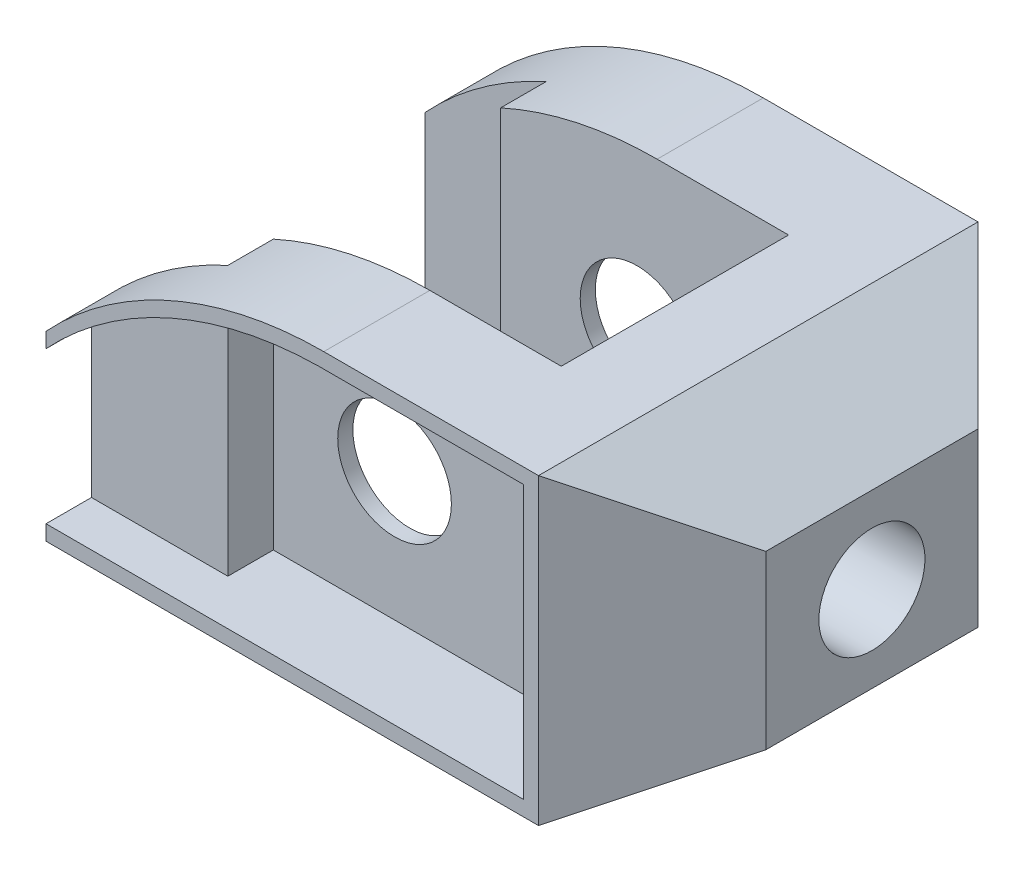
ISO-10303-21;
HEADER;
FILE_DESCRIPTION(('STEP AP214'),'2;1');
FILE_NAME('part.step','',(''),(''),'','','');
FILE_SCHEMA(('AUTOMOTIVE_DESIGN { 1 0 10303 214 1 1 1 1 }'));
ENDSEC;
DATA;
#1=APPLICATION_CONTEXT('core data for automotive mechanical design processes');
#2=APPLICATION_PROTOCOL_DEFINITION('international standard','automotive_design',2000,#1);
#3=PRODUCT_CONTEXT('',#1,'mechanical');
#4=PRODUCT('Part','Part','',(#3));
#5=PRODUCT_RELATED_PRODUCT_CATEGORY('part','',(#4));
#6=PRODUCT_DEFINITION_FORMATION('','',#4);
#7=PRODUCT_DEFINITION_CONTEXT('part definition',#1,'design');
#8=PRODUCT_DEFINITION('design','',#6,#7);
#9=PRODUCT_DEFINITION_SHAPE('','',#8);
#10=(LENGTH_UNIT() NAMED_UNIT(*) SI_UNIT(.MILLI.,.METRE.));
#11=(NAMED_UNIT(*) PLANE_ANGLE_UNIT() SI_UNIT($,.RADIAN.));
#12=(NAMED_UNIT(*) SI_UNIT($,.STERADIAN.) SOLID_ANGLE_UNIT());
#13=UNCERTAINTY_MEASURE_WITH_UNIT(LENGTH_MEASURE(1.E-05),#10,'distance_accuracy_value','');
#14=(GEOMETRIC_REPRESENTATION_CONTEXT(3) GLOBAL_UNCERTAINTY_ASSIGNED_CONTEXT((#13)) GLOBAL_UNIT_ASSIGNED_CONTEXT((#10,
#11,#12)) REPRESENTATION_CONTEXT('',''));
#15=CARTESIAN_POINT('',(0.,0.,0.));
#16=DIRECTION('',(0.,0.,1.));
#17=DIRECTION('',(1.,0.,0.));
#18=AXIS2_PLACEMENT_3D('',#15,#16,#17);
#19=CARTESIAN_POINT('',(-22.,0.,-17.));
#20=DIRECTION('',(1.,0.,0.));
#21=DIRECTION('',(0.,1.,0.));
#22=AXIS2_PLACEMENT_3D('',#19,#20,#21);
#23=PLANE('',#22);
#24=DIRECTION('',(0.,0.,-1.));
#25=VECTOR('',#24,1.);
#26=CARTESIAN_POINT('',(-22.,2.,-17.));
#27=LINE('',#26,#25);
#28=CARTESIAN_POINT('',(-22.,2.,-17.));
#29=VERTEX_POINT('',#28);
#30=CARTESIAN_POINT('',(-22.,2.,-23.));
#31=VERTEX_POINT('',#30);
#32=EDGE_CURVE('E268',#29,#31,#27,.T.);
#33=ORIENTED_EDGE('',*,*,#32,.T.);
#34=DIRECTION('',(0.,-1.,0.));
#35=VECTOR('',#34,1.);
#36=CARTESIAN_POINT('',(-22.,2.,-23.));
#37=LINE('',#36,#35);
#38=CARTESIAN_POINT('',(-22.,34.3900721601075,-23.));
#39=VERTEX_POINT('',#38);
#40=EDGE_CURVE('E275',#39,#31,#37,.T.);
#41=ORIENTED_EDGE('',*,*,#40,.F.);
#42=DIRECTION('',(0.,0.,-1.));
#43=VECTOR('',#42,1.);
#44=CARTESIAN_POINT('',(-22.,34.3900721601075,-17.));
#45=LINE('',#44,#43);
#46=CARTESIAN_POINT('',(-22.,34.3900721601075,-17.));
#47=VERTEX_POINT('',#46);
#48=EDGE_CURVE('E299',#47,#39,#45,.T.);
#49=ORIENTED_EDGE('',*,*,#48,.F.);
#50=DIRECTION('',(0.,-1.,0.));
#51=VECTOR('',#50,1.);
#52=CARTESIAN_POINT('',(-22.,0.,-17.));
#53=LINE('',#52,#51);
#54=EDGE_CURVE('E285',#47,#29,#53,.T.);
#55=ORIENTED_EDGE('',*,*,#54,.T.);
#56=EDGE_LOOP('',(#33,#41,#49,#55));
#57=FACE_BOUND('',#56,.T.);
#58=ADVANCED_FACE('F65',(#57),#23,.T.);
#59=CARTESIAN_POINT('',(-40.,40.,-29.));
#60=DIRECTION('',(0.,0.,1.));
#61=DIRECTION('',(1.,0.,0.));
#62=AXIS2_PLACEMENT_3D('',#59,#60,#61);
#63=PLANE('',#62);
#64=CARTESIAN_POINT('',(-3.33529710869688,-11.995581505432,-29.));
#65=DIRECTION('',(0.,0.,-1.));
#66=DIRECTION('',(-1.,0.,0.));
#67=AXIS2_PLACEMENT_3D('',#64,#65,#66);
#68=CIRCLE('',#67,50.);
#69=CARTESIAN_POINT('',(-40.,22.,-29.));
#70=VERTEX_POINT('',#69);
#71=CARTESIAN_POINT('',(-3.99999999999998,38.,-29.));
#72=VERTEX_POINT('',#71);
#73=EDGE_CURVE('E990',#70,#72,#68,.T.);
#74=ORIENTED_EDGE('',*,*,#73,.F.);
#75=DIRECTION('',(0.,-1.,0.));
#76=VECTOR('',#75,1.);
#77=CARTESIAN_POINT('',(-40.,40.,-29.));
#78=LINE('',#77,#76);
#79=CARTESIAN_POINT('',(-40.,24.,-29.));
#80=VERTEX_POINT('',#79);
#81=EDGE_CURVE('E456',#80,#70,#78,.T.);
#82=ORIENTED_EDGE('',*,*,#81,.F.);
#83=CARTESIAN_POINT('',(-3.33939444035326,-9.99999999999999,-29.));
#84=DIRECTION('',(0.,0.,1.));
#85=DIRECTION('',(1.,0.,0.));
#86=AXIS2_PLACEMENT_3D('',#83,#84,#85);
#87=CIRCLE('',#86,50.);
#88=CARTESIAN_POINT('',(-3.33939444035327,40.,-29.));
#89=VERTEX_POINT('',#88);
#90=EDGE_CURVE('E432',#80,#89,#87,.F.);
#91=ORIENTED_EDGE('',*,*,#90,.T.);
#92=DIRECTION('',(-1.,0.,0.));
#93=VECTOR('',#92,1.);
#94=CARTESIAN_POINT('',(-40.,40.,-29.));
#95=LINE('',#94,#93);
#96=CARTESIAN_POINT('',(25.,40.,-29.));
#97=VERTEX_POINT('',#96);
#98=EDGE_CURVE('E436',#97,#89,#95,.T.);
#99=ORIENTED_EDGE('',*,*,#98,.F.);
#100=DIRECTION('',(0.,-1.,0.));
#101=VECTOR('',#100,1.);
#102=CARTESIAN_POINT('',(25.,98.,-29.));
#103=LINE('',#102,#101);
#104=CARTESIAN_POINT('',(25.,0.,-29.));
#105=VERTEX_POINT('',#104);
#106=EDGE_CURVE('E352',#97,#105,#103,.T.);
#107=ORIENTED_EDGE('',*,*,#106,.T.);
#108=DIRECTION('',(-1.,0.,0.));
#109=VECTOR('',#108,1.);
#110=CARTESIAN_POINT('',(-40.,0.,-29.));
#111=LINE('',#110,#109);
#112=CARTESIAN_POINT('',(-40.,0.,-29.));
#113=VERTEX_POINT('',#112);
#114=EDGE_CURVE('E435',#105,#113,#111,.T.);
#115=ORIENTED_EDGE('',*,*,#114,.T.);
#116=CARTESIAN_POINT('',(-40.,2.,-29.));
#117=VERTEX_POINT('',#116);
#118=EDGE_CURVE('E455',#117,#113,#78,.T.);
#119=ORIENTED_EDGE('',*,*,#118,.F.);
#120=DIRECTION('',(-1.,0.,0.));
#121=VECTOR('',#120,1.);
#122=CARTESIAN_POINT('',(0.,2.,-29.));
#123=LINE('',#122,#121);
#124=CARTESIAN_POINT('',(23.,2.,-29.));
#125=VERTEX_POINT('',#124);
#126=EDGE_CURVE('E293',#125,#117,#123,.T.);
#127=ORIENTED_EDGE('',*,*,#126,.F.);
#128=DIRECTION('',(0.,-1.,0.));
#129=VECTOR('',#128,1.);
#130=CARTESIAN_POINT('',(23.,0.,-29.));
#131=LINE('',#130,#129);
#132=CARTESIAN_POINT('',(23.,38.,-29.));
#133=VERTEX_POINT('',#132);
#134=EDGE_CURVE('E1011',#133,#125,#131,.T.);
#135=ORIENTED_EDGE('',*,*,#134,.F.);
#136=DIRECTION('',(-1.,0.,0.));
#137=VECTOR('',#136,1.);
#138=CARTESIAN_POINT('',(0.,38.,-29.));
#139=LINE('',#138,#137);
#140=EDGE_CURVE('E1009',#133,#72,#139,.T.);
#141=ORIENTED_EDGE('',*,*,#140,.T.);
#142=EDGE_LOOP('',(#74,#82,#91,#99,#107,#115,#119,#127,#135,#141));
#143=FACE_BOUND('',#142,.T.);
#144=ADVANCED_FACE('F509',(#143),#63,.F.);
#145=CARTESIAN_POINT('',(-5.99999999999999,19.,58.));
#146=DIRECTION('',(0.,0.,-1.));
#147=DIRECTION('',(-1.,0.,0.));
#148=AXIS2_PLACEMENT_3D('',#145,#146,#147);
#149=CYLINDRICAL_SURFACE('',#148,7.5);
#150=CARTESIAN_POINT('',(-5.99999999999999,19.,-15.));
#151=DIRECTION('',(0.,0.,-1.));
#152=DIRECTION('',(-1.,0.,0.));
#153=AXIS2_PLACEMENT_3D('',#150,#151,#152);
#154=CIRCLE('',#153,7.5);
#155=CARTESIAN_POINT('',(-13.5,19.,-15.));
#156=VERTEX_POINT('',#155);
#157=EDGE_CURVE('E413',#156,#156,#154,.T.);
#158=ORIENTED_EDGE('',*,*,#157,.F.);
#159=EDGE_LOOP('',(#158));
#160=FACE_BOUND('',#159,.T.);
#161=CARTESIAN_POINT('',(-5.99999999999999,19.,-17.));
#162=DIRECTION('',(0.,0.,-1.));
#163=DIRECTION('',(-1.,0.,0.));
#164=AXIS2_PLACEMENT_3D('',#161,#162,#163);
#165=CIRCLE('',#164,7.5);
#166=CARTESIAN_POINT('',(-13.5,19.,-17.));
#167=VERTEX_POINT('',#166);
#168=EDGE_CURVE('E994',#167,#167,#165,.F.);
#169=ORIENTED_EDGE('',*,*,#168,.F.);
#170=EDGE_LOOP('',(#169));
#171=FACE_BOUND('',#170,.T.);
#172=ADVANCED_FACE('F539',(#160,#171),#149,.F.);
#173=CARTESIAN_POINT('',(-22.,0.,17.));
#174=DIRECTION('',(-1.,0.,0.));
#175=DIRECTION('',(0.,-1.,0.));
#176=AXIS2_PLACEMENT_3D('',#173,#174,#175);
#177=PLANE('',#176);
#178=DIRECTION('',(0.,1.,0.));
#179=VECTOR('',#178,1.);
#180=CARTESIAN_POINT('',(-22.,1.99999999999999,23.));
#181=LINE('',#180,#179);
#182=CARTESIAN_POINT('',(-22.,1.99999999999999,23.));
#183=VERTEX_POINT('',#182);
#184=CARTESIAN_POINT('',(-22.,34.3900721601075,23.));
#185=VERTEX_POINT('',#184);
#186=EDGE_CURVE('E80',#183,#185,#181,.T.);
#187=ORIENTED_EDGE('',*,*,#186,.F.);
#188=DIRECTION('',(0.,0.,1.));
#189=VECTOR('',#188,1.);
#190=CARTESIAN_POINT('',(-22.,1.99999999999999,17.));
#191=LINE('',#190,#189);
#192=CARTESIAN_POINT('',(-22.,1.99999999999999,17.));
#193=VERTEX_POINT('',#192);
#194=EDGE_CURVE('E345',#193,#183,#191,.T.);
#195=ORIENTED_EDGE('',*,*,#194,.F.);
#196=DIRECTION('',(0.,-1.,0.));
#197=VECTOR('',#196,1.);
#198=CARTESIAN_POINT('',(-22.,0.,17.));
#199=LINE('',#198,#197);
#200=CARTESIAN_POINT('',(-22.,34.3900721601075,17.));
#201=VERTEX_POINT('',#200);
#202=EDGE_CURVE('E323',#201,#193,#199,.T.);
#203=ORIENTED_EDGE('',*,*,#202,.F.);
#204=DIRECTION('',(0.,0.,1.));
#205=VECTOR('',#204,1.);
#206=CARTESIAN_POINT('',(-22.,34.3900721601075,17.));
#207=LINE('',#206,#205);
#208=EDGE_CURVE('E348',#201,#185,#207,.T.);
#209=ORIENTED_EDGE('',*,*,#208,.T.);
#210=EDGE_LOOP('',(#187,#195,#203,#209));
#211=FACE_BOUND('',#210,.T.);
#212=ADVANCED_FACE('F560',(#211),#177,.F.);
#213=CARTESIAN_POINT('',(-5.99999999999999,19.,15.));
#214=DIRECTION('',(0.,0.,-1.));
#215=DIRECTION('',(-1.,0.,0.));
#216=AXIS2_PLACEMENT_3D('',#213,#214,#215);
#217=CIRCLE('',#216,7.5);
#218=CARTESIAN_POINT('',(-13.5,19.,15.));
#219=VERTEX_POINT('',#218);
#220=EDGE_CURVE('E406',#219,#219,#217,.T.);
#221=ORIENTED_EDGE('',*,*,#220,.T.);
#222=EDGE_LOOP('',(#221));
#223=FACE_BOUND('',#222,.T.);
#224=CARTESIAN_POINT('',(-5.99999999999999,19.,17.));
#225=DIRECTION('',(0.,0.,1.));
#226=DIRECTION('',(1.,0.,0.));
#227=AXIS2_PLACEMENT_3D('',#224,#225,#226);
#228=CIRCLE('',#227,7.5);
#229=CARTESIAN_POINT('',(1.5,19.,17.));
#230=VERTEX_POINT('',#229);
#231=EDGE_CURVE('E313',#230,#230,#228,.F.);
#232=ORIENTED_EDGE('',*,*,#231,.F.);
#233=EDGE_LOOP('',(#232));
#234=FACE_BOUND('',#233,.T.);
#235=ADVANCED_FACE('F563',(#223,#234),#149,.F.);
#236=CARTESIAN_POINT('',(40.,40.,-29.));
#237=DIRECTION('',(-1.,0.,0.));
#238=DIRECTION('',(0.,0.,1.));
#239=AXIS2_PLACEMENT_3D('',#236,#237,#238);
#240=PLANE('',#239);
#241=CARTESIAN_POINT('',(40.,20.,0.));
#242=DIRECTION('',(-1.,0.,0.));
#243=DIRECTION('',(0.,0.,1.));
#244=AXIS2_PLACEMENT_3D('',#241,#242,#243);
#245=CIRCLE('',#244,7.);
#246=CARTESIAN_POINT('',(40.,20.,7.));
#247=VERTEX_POINT('',#246);
#248=EDGE_CURVE('E368',#247,#247,#245,.F.);
#249=ORIENTED_EDGE('',*,*,#248,.F.);
#250=EDGE_LOOP('',(#249));
#251=FACE_BOUND('',#250,.T.);
#252=DIRECTION('',(0.,-1.,0.));
#253=VECTOR('',#252,1.);
#254=CARTESIAN_POINT('',(40.,98.,-14.));
#255=LINE('',#254,#253);
#256=CARTESIAN_POINT('',(40.,31.3397459621557,-14.));
#257=VERTEX_POINT('',#256);
#258=CARTESIAN_POINT('',(40.,8.66025403784428,-14.));
#259=VERTEX_POINT('',#258);
#260=EDGE_CURVE('E355',#257,#259,#255,.T.);
#261=ORIENTED_EDGE('',*,*,#260,.F.);
#262=DIRECTION('',(0.,0.,-1.));
#263=VECTOR('',#262,1.);
#264=CARTESIAN_POINT('',(40.,31.3397459621557,58.));
#265=LINE('',#264,#263);
#266=CARTESIAN_POINT('',(40.,31.3397459621557,14.0000000000002));
#267=VERTEX_POINT('',#266);
#268=EDGE_CURVE('E420',#267,#257,#265,.T.);
#269=ORIENTED_EDGE('',*,*,#268,.F.);
#270=DIRECTION('',(0.,-1.,0.));
#271=VECTOR('',#270,1.);
#272=CARTESIAN_POINT('',(40.,98.,14.0000000000002));
#273=LINE('',#272,#271);
#274=CARTESIAN_POINT('',(40.,8.66025403784428,14.0000000000002));
#275=VERTEX_POINT('',#274);
#276=EDGE_CURVE('E341',#267,#275,#273,.T.);
#277=ORIENTED_EDGE('',*,*,#276,.T.);
#278=DIRECTION('',(0.,0.,1.));
#279=VECTOR('',#278,1.);
#280=CARTESIAN_POINT('',(40.,8.66025403784428,-58.));
#281=LINE('',#280,#279);
#282=EDGE_CURVE('E419',#259,#275,#281,.T.);
#283=ORIENTED_EDGE('',*,*,#282,.F.);
#284=EDGE_LOOP('',(#261,#269,#277,#283));
#285=FACE_BOUND('',#284,.T.);
#286=ADVANCED_FACE('F67',(#251,#285),#240,.F.);
#287=CARTESIAN_POINT('',(-40.,40.,29.));
#288=DIRECTION('',(0.,0.,-1.));
#289=DIRECTION('',(-1.,0.,0.));
#290=AXIS2_PLACEMENT_3D('',#287,#288,#289);
#291=PLANE('',#290);
#292=DIRECTION('',(-1.,0.,0.));
#293=VECTOR('',#292,1.);
#294=CARTESIAN_POINT('',(0.,2.,29.));
#295=LINE('',#294,#293);
#296=CARTESIAN_POINT('',(23.,2.,29.));
#297=VERTEX_POINT('',#296);
#298=CARTESIAN_POINT('',(-40.,1.99999999999999,29.));
#299=VERTEX_POINT('',#298);
#300=EDGE_CURVE('E335',#297,#299,#295,.T.);
#301=ORIENTED_EDGE('',*,*,#300,.T.);
#302=DIRECTION('',(0.,-1.,0.));
#303=VECTOR('',#302,1.);
#304=CARTESIAN_POINT('',(-40.,40.,29.));
#305=LINE('',#304,#303);
#306=CARTESIAN_POINT('',(-40.,0.,29.));
#307=VERTEX_POINT('',#306);
#308=EDGE_CURVE('E443',#299,#307,#305,.T.);
#309=ORIENTED_EDGE('',*,*,#308,.T.);
#310=DIRECTION('',(1.,0.,0.));
#311=VECTOR('',#310,1.);
#312=CARTESIAN_POINT('',(-40.,0.,29.));
#313=LINE('',#312,#311);
#314=CARTESIAN_POINT('',(25.,0.,29.));
#315=VERTEX_POINT('',#314);
#316=EDGE_CURVE('E440',#307,#315,#313,.T.);
#317=ORIENTED_EDGE('',*,*,#316,.T.);
#318=DIRECTION('',(0.,-1.,0.));
#319=VECTOR('',#318,1.);
#320=CARTESIAN_POINT('',(25.,98.,29.));
#321=LINE('',#320,#319);
#322=CARTESIAN_POINT('',(25.,40.,29.));
#323=VERTEX_POINT('',#322);
#324=EDGE_CURVE('E356',#323,#315,#321,.T.);
#325=ORIENTED_EDGE('',*,*,#324,.F.);
#326=DIRECTION('',(1.,0.,0.));
#327=VECTOR('',#326,1.);
#328=CARTESIAN_POINT('',(-40.,40.,29.));
#329=LINE('',#328,#327);
#330=CARTESIAN_POINT('',(-3.33939444035326,40.,29.));
#331=VERTEX_POINT('',#330);
#332=EDGE_CURVE('E439',#331,#323,#329,.T.);
#333=ORIENTED_EDGE('',*,*,#332,.F.);
#334=CARTESIAN_POINT('',(-3.33939444035326,-9.99999999999999,29.));
#335=DIRECTION('',(0.,0.,-1.));
#336=DIRECTION('',(-1.,0.,0.));
#337=AXIS2_PLACEMENT_3D('',#334,#335,#336);
#338=CIRCLE('',#337,50.);
#339=CARTESIAN_POINT('',(-40.,24.,29.));
#340=VERTEX_POINT('',#339);
#341=EDGE_CURVE('E429',#331,#340,#338,.F.);
#342=ORIENTED_EDGE('',*,*,#341,.T.);
#343=CARTESIAN_POINT('',(-40.,22.,29.));
#344=VERTEX_POINT('',#343);
#345=EDGE_CURVE('E452',#340,#344,#305,.T.);
#346=ORIENTED_EDGE('',*,*,#345,.T.);
#347=CARTESIAN_POINT('',(-3.33529710869688,-11.995581505432,29.));
#348=DIRECTION('',(0.,0.,1.));
#349=DIRECTION('',(1.,0.,0.));
#350=AXIS2_PLACEMENT_3D('',#347,#348,#349);
#351=CIRCLE('',#350,50.);
#352=CARTESIAN_POINT('',(-4.,38.,29.));
#353=VERTEX_POINT('',#352);
#354=EDGE_CURVE('E333',#353,#344,#351,.T.);
#355=ORIENTED_EDGE('',*,*,#354,.F.);
#356=DIRECTION('',(-1.,0.,0.));
#357=VECTOR('',#356,1.);
#358=CARTESIAN_POINT('',(0.,38.,29.));
#359=LINE('',#358,#357);
#360=CARTESIAN_POINT('',(23.,38.,29.));
#361=VERTEX_POINT('',#360);
#362=EDGE_CURVE('E88',#361,#353,#359,.T.);
#363=ORIENTED_EDGE('',*,*,#362,.F.);
#364=DIRECTION('',(0.,-1.,0.));
#365=VECTOR('',#364,1.);
#366=CARTESIAN_POINT('',(23.,0.,29.));
#367=LINE('',#366,#365);
#368=EDGE_CURVE('E317',#361,#297,#367,.T.);
#369=ORIENTED_EDGE('',*,*,#368,.T.);
#370=EDGE_LOOP('',(#301,#309,#317,#325,#333,#342,#346,#355,#363,#369));
#371=FACE_BOUND('',#370,.T.);
#372=ADVANCED_FACE('F519',(#371),#291,.F.);
#373=CARTESIAN_POINT('',(6.24999999999989,-10.8253175473054,-58.));
#374=DIRECTION('',(0.499999999999995,-0.866025403784441,0.));
#375=DIRECTION('',(0.866025403784441,0.499999999999995,0.));
#376=AXIS2_PLACEMENT_3D('',#373,#374,#375);
#377=PLANE('',#376);
#378=DIRECTION('',(0.,0.,-1.));
#379=VECTOR('',#378,1.);
#380=CARTESIAN_POINT('',(25.,0.,0.));
#381=LINE('',#380,#379);
#382=EDGE_CURVE('E459',#315,#105,#381,.T.);
#383=ORIENTED_EDGE('',*,*,#382,.T.);
#384=DIRECTION('',(0.654653670707978,0.377964473009223,0.65465367070798));
#385=VECTOR('',#384,1.);
#386=CARTESIAN_POINT('',(1.8571428571428,-13.3615348012455,-52.1428571428573));
#387=LINE('',#386,#385);
#388=EDGE_CURVE('E364',#105,#259,#387,.T.);
#389=ORIENTED_EDGE('',*,*,#388,.T.);
#390=ORIENTED_EDGE('',*,*,#282,.T.);
#391=DIRECTION('',(-0.654653670707981,-0.377964473009225,0.654653670707975));
#392=VECTOR('',#391,1.);
#393=CARTESIAN_POINT('',(51.5714285714285,15.341021438467,2.42857142857177));
#394=LINE('',#393,#392);
#395=EDGE_CURVE('E358',#275,#315,#394,.T.);
#396=ORIENTED_EDGE('',*,*,#395,.T.);
#397=EDGE_LOOP('',(#383,#389,#390,#396));
#398=FACE_BOUND('',#397,.T.);
#399=ADVANCED_FACE('F498',(#398),#377,.T.);
#400=CARTESIAN_POINT('',(23.5705080756885,40.8253175473056,58.));
#401=DIRECTION('',(0.499999999999995,0.866025403784442,0.));
#402=DIRECTION('',(-0.866025403784442,0.499999999999995,0.));
#403=AXIS2_PLACEMENT_3D('',#400,#401,#402);
#404=PLANE('',#403);
#405=ORIENTED_EDGE('',*,*,#268,.T.);
#406=DIRECTION('',(-0.654653670707978,0.377964473009222,-0.65465367070798));
#407=VECTOR('',#406,1.);
#408=CARTESIAN_POINT('',(61.4688617575365,18.9446928472474,7.46886175753658));
#409=LINE('',#408,#407);
#410=EDGE_CURVE('E12',#257,#97,#409,.T.);
#411=ORIENTED_EDGE('',*,*,#410,.T.);
#412=DIRECTION('',(0.,0.,-1.));
#413=VECTOR('',#412,1.);
#414=CARTESIAN_POINT('',(25.,40.,0.));
#415=LINE('',#414,#413);
#416=EDGE_CURVE('E466',#323,#97,#415,.T.);
#417=ORIENTED_EDGE('',*,*,#416,.F.);
#418=DIRECTION('',(0.654653670707981,-0.377964473009224,-0.654653670707975));
#419=VECTOR('',#418,1.);
#420=CARTESIAN_POINT('',(11.7545760432505,47.6472490869599,42.2454239567493));
#421=LINE('',#420,#419);
#422=EDGE_CURVE('E73',#323,#267,#421,.T.);
#423=ORIENTED_EDGE('',*,*,#422,.T.);
#424=EDGE_LOOP('',(#405,#411,#417,#423));
#425=FACE_BOUND('',#424,.T.);
#426=ADVANCED_FACE('F489',(#425),#404,.T.);
#427=CARTESIAN_POINT('',(-40.,40.,-29.));
#428=DIRECTION('',(1.,0.,0.));
#429=DIRECTION('',(0.,0.,-1.));
#430=AXIS2_PLACEMENT_3D('',#427,#428,#429);
#431=PLANE('',#430);
#432=ORIENTED_EDGE('',*,*,#308,.F.);
#433=DIRECTION('',(0.,0.,1.));
#434=VECTOR('',#433,1.);
#435=CARTESIAN_POINT('',(-40.,1.99999999999999,23.));
#436=LINE('',#435,#434);
#437=CARTESIAN_POINT('',(-40.,1.99999999999999,23.));
#438=VERTEX_POINT('',#437);
#439=EDGE_CURVE('E308',#438,#299,#436,.T.);
#440=ORIENTED_EDGE('',*,*,#439,.F.);
#441=DIRECTION('',(0.,-1.,0.));
#442=VECTOR('',#441,1.);
#443=CARTESIAN_POINT('',(-40.,1.99999999999999,23.));
#444=LINE('',#443,#442);
#445=CARTESIAN_POINT('',(-40.,22.,23.));
#446=VERTEX_POINT('',#445);
#447=EDGE_CURVE('E303',#446,#438,#444,.T.);
#448=ORIENTED_EDGE('',*,*,#447,.F.);
#449=DIRECTION('',(0.,0.,1.));
#450=VECTOR('',#449,1.);
#451=CARTESIAN_POINT('',(-40.,22.,23.));
#452=LINE('',#451,#450);
#453=EDGE_CURVE('E307',#446,#344,#452,.T.);
#454=ORIENTED_EDGE('',*,*,#453,.T.);
#455=ORIENTED_EDGE('',*,*,#345,.F.);
#456=DIRECTION('',(0.,0.,-1.));
#457=VECTOR('',#456,1.);
#458=CARTESIAN_POINT('',(-40.,24.,58.));
#459=LINE('',#458,#457);
#460=CARTESIAN_POINT('',(-40.,24.,21.));
#461=VERTEX_POINT('',#460);
#462=EDGE_CURVE('E426',#340,#461,#459,.T.);
#463=ORIENTED_EDGE('',*,*,#462,.T.);
#464=DIRECTION('',(0.,-1.,0.));
#465=VECTOR('',#464,1.);
#466=CARTESIAN_POINT('',(-40.,98.,21.));
#467=LINE('',#466,#465);
#468=CARTESIAN_POINT('',(-40.,0.,21.));
#469=VERTEX_POINT('',#468);
#470=EDGE_CURVE('E371',#461,#469,#467,.T.);
#471=ORIENTED_EDGE('',*,*,#470,.T.);
#472=DIRECTION('',(0.,0.,1.));
#473=VECTOR('',#472,1.);
#474=CARTESIAN_POINT('',(-40.,0.,-29.));
#475=LINE('',#474,#473);
#476=EDGE_CURVE('E446',#469,#307,#475,.T.);
#477=ORIENTED_EDGE('',*,*,#476,.T.);
#478=EDGE_LOOP('',(#432,#440,#448,#454,#455,#463,#471,#477));
#479=FACE_BOUND('',#478,.T.);
#480=ADVANCED_FACE('F770',(#479),#431,.F.);
#481=CARTESIAN_POINT('',(-3.33939444035326,-9.99999999999999,58.));
#482=DIRECTION('',(0.,0.,-1.));
#483=DIRECTION('',(-1.,0.,0.));
#484=AXIS2_PLACEMENT_3D('',#481,#482,#483);
#485=CYLINDRICAL_SURFACE('',#484,50.);
#486=CARTESIAN_POINT('',(-3.33939444035326,-9.99999999999999,21.));
#487=DIRECTION('',(0.,0.,-1.));
#488=DIRECTION('',(-1.,0.,0.));
#489=AXIS2_PLACEMENT_3D('',#486,#487,#488);
#490=CIRCLE('',#489,50.);
#491=CARTESIAN_POINT('',(-24.,35.5317403347236,21.));
#492=VERTEX_POINT('',#491);
#493=EDGE_CURVE('E392',#461,#492,#490,.T.);
#494=ORIENTED_EDGE('',*,*,#493,.F.);
#495=ORIENTED_EDGE('',*,*,#462,.F.);
#496=ORIENTED_EDGE('',*,*,#341,.F.);
#497=DIRECTION('',(0.,0.,-1.));
#498=VECTOR('',#497,1.);
#499=CARTESIAN_POINT('',(-3.33939444035326,40.,58.));
#500=LINE('',#499,#498);
#501=CARTESIAN_POINT('',(-3.33939444035326,40.,15.));
#502=VERTEX_POINT('',#501);
#503=EDGE_CURVE('E462',#502,#331,#500,.F.);
#504=ORIENTED_EDGE('',*,*,#503,.F.);
#505=CARTESIAN_POINT('',(-3.33939444035326,-9.99999999999999,15.));
#506=DIRECTION('',(0.,0.,-1.));
#507=DIRECTION('',(-1.,0.,0.));
#508=AXIS2_PLACEMENT_3D('',#505,#506,#507);
#509=CIRCLE('',#508,50.);
#510=CARTESIAN_POINT('',(-24.,35.5317403347236,15.));
#511=VERTEX_POINT('',#510);
#512=EDGE_CURVE('E408',#511,#502,#509,.T.);
#513=ORIENTED_EDGE('',*,*,#512,.F.);
#514=DIRECTION('',(0.,0.,-1.));
#515=VECTOR('',#514,1.);
#516=CARTESIAN_POINT('',(-24.,35.5317403347236,58.));
#517=LINE('',#516,#515);
#518=EDGE_CURVE('E384',#492,#511,#517,.T.);
#519=ORIENTED_EDGE('',*,*,#518,.F.);
#520=EDGE_LOOP('',(#494,#495,#496,#504,#513,#519));
#521=FACE_BOUND('',#520,.T.);
#522=ADVANCED_FACE('F825',(#521),#485,.T.);
#523=CARTESIAN_POINT('',(0.,0.,0.));
#524=DIRECTION('',(0.,1.,0.));
#525=DIRECTION('',(0.,0.,1.));
#526=AXIS2_PLACEMENT_3D('',#523,#524,#525);
#527=PLANE('',#526);
#528=DIRECTION('',(0.,0.,1.));
#529=VECTOR('',#528,1.);
#530=CARTESIAN_POINT('',(-24.,0.,0.));
#531=LINE('',#530,#529);
#532=CARTESIAN_POINT('',(-24.,0.,-21.));
#533=VERTEX_POINT('',#532);
#534=CARTESIAN_POINT('',(-24.,0.,-15.));
#535=VERTEX_POINT('',#534);
#536=EDGE_CURVE('E388',#533,#535,#531,.T.);
#537=ORIENTED_EDGE('',*,*,#536,.F.);
#538=DIRECTION('',(1.,0.,0.));
#539=VECTOR('',#538,1.);
#540=CARTESIAN_POINT('',(0.,0.,-21.));
#541=LINE('',#540,#539);
#542=CARTESIAN_POINT('',(-40.,0.,-21.));
#543=VERTEX_POINT('',#542);
#544=EDGE_CURVE('E390',#543,#533,#541,.T.);
#545=ORIENTED_EDGE('',*,*,#544,.F.);
#546=EDGE_CURVE('E447',#113,#543,#475,.T.);
#547=ORIENTED_EDGE('',*,*,#546,.F.);
#548=ORIENTED_EDGE('',*,*,#114,.F.);
#549=ORIENTED_EDGE('',*,*,#382,.F.);
#550=ORIENTED_EDGE('',*,*,#316,.F.);
#551=ORIENTED_EDGE('',*,*,#476,.F.);
#552=DIRECTION('',(-1.,0.,0.));
#553=VECTOR('',#552,1.);
#554=CARTESIAN_POINT('',(0.,0.,21.));
#555=LINE('',#554,#553);
#556=CARTESIAN_POINT('',(-24.,0.,21.));
#557=VERTEX_POINT('',#556);
#558=EDGE_CURVE('E482',#557,#469,#555,.T.);
#559=ORIENTED_EDGE('',*,*,#558,.F.);
#560=DIRECTION('',(0.,0.,1.));
#561=VECTOR('',#560,1.);
#562=CARTESIAN_POINT('',(-24.,0.,0.));
#563=LINE('',#562,#561);
#564=CARTESIAN_POINT('',(-24.,0.,15.));
#565=VERTEX_POINT('',#564);
#566=EDGE_CURVE('E378',#565,#557,#563,.T.);
#567=ORIENTED_EDGE('',*,*,#566,.F.);
#568=DIRECTION('',(-1.,0.,0.));
#569=VECTOR('',#568,1.);
#570=CARTESIAN_POINT('',(0.,0.,15.));
#571=LINE('',#570,#569);
#572=CARTESIAN_POINT('',(14.,0.,15.));
#573=VERTEX_POINT('',#572);
#574=EDGE_CURVE('E410',#573,#565,#571,.T.);
#575=ORIENTED_EDGE('',*,*,#574,.F.);
#576=DIRECTION('',(0.,0.,1.));
#577=VECTOR('',#576,1.);
#578=CARTESIAN_POINT('',(14.,0.,0.));
#579=LINE('',#578,#577);
#580=CARTESIAN_POINT('',(14.,0.,-15.));
#581=VERTEX_POINT('',#580);
#582=EDGE_CURVE('E469',#581,#573,#579,.T.);
#583=ORIENTED_EDGE('',*,*,#582,.F.);
#584=DIRECTION('',(-1.,0.,0.));
#585=VECTOR('',#584,1.);
#586=CARTESIAN_POINT('',(0.,0.,-15.));
#587=LINE('',#586,#585);
#588=EDGE_CURVE('E416',#581,#535,#587,.T.);
#589=ORIENTED_EDGE('',*,*,#588,.T.);
#590=EDGE_LOOP('',(#537,#545,#547,#548,#549,#550,#551,#559,#567,#575,#583,#589));
#591=FACE_BOUND('',#590,.T.);
#592=ADVANCED_FACE('F505',(#591),#527,.F.);
#593=ORIENTED_EDGE('',*,*,#81,.T.);
#594=DIRECTION('',(0.,0.,-1.));
#595=VECTOR('',#594,1.);
#596=CARTESIAN_POINT('',(-40.,22.,-23.));
#597=LINE('',#596,#595);
#598=CARTESIAN_POINT('',(-40.,22.,-23.));
#599=VERTEX_POINT('',#598);
#600=EDGE_CURVE('E987',#599,#70,#597,.T.);
#601=ORIENTED_EDGE('',*,*,#600,.F.);
#602=DIRECTION('',(0.,1.,0.));
#603=VECTOR('',#602,1.);
#604=CARTESIAN_POINT('',(-40.,2.,-23.));
#605=LINE('',#604,#603);
#606=CARTESIAN_POINT('',(-40.,2.,-23.));
#607=VERTEX_POINT('',#606);
#608=EDGE_CURVE('E274',#607,#599,#605,.T.);
#609=ORIENTED_EDGE('',*,*,#608,.F.);
#610=DIRECTION('',(0.,0.,-1.));
#611=VECTOR('',#610,1.);
#612=CARTESIAN_POINT('',(-40.,2.,-23.));
#613=LINE('',#612,#611);
#614=EDGE_CURVE('E271',#607,#117,#613,.T.);
#615=ORIENTED_EDGE('',*,*,#614,.T.);
#616=ORIENTED_EDGE('',*,*,#118,.T.);
#617=ORIENTED_EDGE('',*,*,#546,.T.);
#618=DIRECTION('',(0.,-1.,0.));
#619=VECTOR('',#618,1.);
#620=CARTESIAN_POINT('',(-40.,98.,-21.));
#621=LINE('',#620,#619);
#622=CARTESIAN_POINT('',(-40.,24.,-21.));
#623=VERTEX_POINT('',#622);
#624=EDGE_CURVE('E372',#623,#543,#621,.T.);
#625=ORIENTED_EDGE('',*,*,#624,.F.);
#626=EDGE_CURVE('E423',#623,#80,#459,.T.);
#627=ORIENTED_EDGE('',*,*,#626,.T.);
#628=EDGE_LOOP('',(#593,#601,#609,#615,#616,#617,#625,#627));
#629=FACE_BOUND('',#628,.T.);
#630=ADVANCED_FACE('F828',(#629),#431,.F.);
#631=DIRECTION('',(0.,0.,-1.));
#632=VECTOR('',#631,1.);
#633=CARTESIAN_POINT('',(-24.,35.5317403347236,58.));
#634=LINE('',#633,#632);
#635=CARTESIAN_POINT('',(-24.,35.5317403347236,-15.));
#636=VERTEX_POINT('',#635);
#637=CARTESIAN_POINT('',(-24.,35.5317403347236,-21.));
#638=VERTEX_POINT('',#637);
#639=EDGE_CURVE('E386',#636,#638,#634,.T.);
#640=ORIENTED_EDGE('',*,*,#639,.F.);
#641=CARTESIAN_POINT('',(-3.33939444035326,-9.99999999999999,-15.));
#642=DIRECTION('',(0.,0.,-1.));
#643=DIRECTION('',(-1.,0.,0.));
#644=AXIS2_PLACEMENT_3D('',#641,#642,#643);
#645=CIRCLE('',#644,50.);
#646=CARTESIAN_POINT('',(-3.33939444035326,40.,-15.));
#647=VERTEX_POINT('',#646);
#648=EDGE_CURVE('E414',#636,#647,#645,.T.);
#649=ORIENTED_EDGE('',*,*,#648,.T.);
#650=EDGE_CURVE('E463',#89,#647,#500,.F.);
#651=ORIENTED_EDGE('',*,*,#650,.F.);
#652=ORIENTED_EDGE('',*,*,#90,.F.);
#653=ORIENTED_EDGE('',*,*,#626,.F.);
#654=CARTESIAN_POINT('',(-3.33939444035326,-9.99999999999999,-21.));
#655=DIRECTION('',(0.,0.,1.));
#656=DIRECTION('',(1.,0.,0.));
#657=AXIS2_PLACEMENT_3D('',#654,#655,#656);
#658=CIRCLE('',#657,50.);
#659=EDGE_CURVE('E480',#638,#623,#658,.T.);
#660=ORIENTED_EDGE('',*,*,#659,.F.);
#661=EDGE_LOOP('',(#640,#649,#651,#652,#653,#660));
#662=FACE_BOUND('',#661,.T.);
#663=ADVANCED_FACE('F837',(#662),#485,.T.);
#664=CARTESIAN_POINT('',(0.,-18.,-15.));
#665=DIRECTION('',(0.,0.,-1.));
#666=DIRECTION('',(-1.,0.,0.));
#667=AXIS2_PLACEMENT_3D('',#664,#665,#666);
#668=PLANE('',#667);
#669=ORIENTED_EDGE('',*,*,#157,.T.);
#670=EDGE_LOOP('',(#669));
#671=FACE_BOUND('',#670,.T.);
#672=DIRECTION('',(0.,1.,0.));
#673=VECTOR('',#672,1.);
#674=CARTESIAN_POINT('',(-24.,-18.,-15.));
#675=LINE('',#674,#673);
#676=EDGE_CURVE('E478',#535,#636,#675,.T.);
#677=ORIENTED_EDGE('',*,*,#676,.F.);
#678=ORIENTED_EDGE('',*,*,#588,.F.);
#679=DIRECTION('',(0.,1.,0.));
#680=VECTOR('',#679,1.);
#681=CARTESIAN_POINT('',(14.,-18.,-15.));
#682=LINE('',#681,#680);
#683=CARTESIAN_POINT('',(14.,40.,-15.));
#684=VERTEX_POINT('',#683);
#685=EDGE_CURVE('E404',#581,#684,#682,.T.);
#686=ORIENTED_EDGE('',*,*,#685,.T.);
#687=DIRECTION('',(-1.,0.,0.));
#688=VECTOR('',#687,1.);
#689=CARTESIAN_POINT('',(0.,40.,-15.));
#690=LINE('',#689,#688);
#691=EDGE_CURVE('E394',#684,#647,#690,.T.);
#692=ORIENTED_EDGE('',*,*,#691,.T.);
#693=ORIENTED_EDGE('',*,*,#648,.F.);
#694=EDGE_LOOP('',(#677,#678,#686,#692,#693));
#695=FACE_BOUND('',#694,.T.);
#696=ADVANCED_FACE('F864',(#671,#695),#668,.F.);
#697=CARTESIAN_POINT('',(0.,-18.,15.));
#698=DIRECTION('',(0.,0.,-1.));
#699=DIRECTION('',(-1.,0.,0.));
#700=AXIS2_PLACEMENT_3D('',#697,#698,#699);
#701=PLANE('',#700);
#702=ORIENTED_EDGE('',*,*,#220,.F.);
#703=EDGE_LOOP('',(#702));
#704=FACE_BOUND('',#703,.T.);
#705=ORIENTED_EDGE('',*,*,#574,.T.);
#706=DIRECTION('',(0.,1.,0.));
#707=VECTOR('',#706,1.);
#708=CARTESIAN_POINT('',(-24.,-18.,15.));
#709=LINE('',#708,#707);
#710=EDGE_CURVE('E475',#565,#511,#709,.T.);
#711=ORIENTED_EDGE('',*,*,#710,.T.);
#712=ORIENTED_EDGE('',*,*,#512,.T.);
#713=DIRECTION('',(-1.,0.,0.));
#714=VECTOR('',#713,1.);
#715=CARTESIAN_POINT('',(0.,40.,15.));
#716=LINE('',#715,#714);
#717=CARTESIAN_POINT('',(14.,40.,15.));
#718=VERTEX_POINT('',#717);
#719=EDGE_CURVE('E397',#718,#502,#716,.T.);
#720=ORIENTED_EDGE('',*,*,#719,.F.);
#721=DIRECTION('',(0.,1.,0.));
#722=VECTOR('',#721,1.);
#723=CARTESIAN_POINT('',(14.,-18.,15.));
#724=LINE('',#723,#722);
#725=EDGE_CURVE('E403',#573,#718,#724,.T.);
#726=ORIENTED_EDGE('',*,*,#725,.F.);
#727=EDGE_LOOP('',(#705,#711,#712,#720,#726));
#728=FACE_BOUND('',#727,.T.);
#729=ADVANCED_FACE('F874',(#704,#728),#701,.T.);
#730=CARTESIAN_POINT('',(0.,40.,0.));
#731=DIRECTION('',(0.,1.,0.));
#732=DIRECTION('',(0.,0.,1.));
#733=AXIS2_PLACEMENT_3D('',#730,#731,#732);
#734=PLANE('',#733);
#735=ORIENTED_EDGE('',*,*,#691,.F.);
#736=DIRECTION('',(0.,0.,1.));
#737=VECTOR('',#736,1.);
#738=CARTESIAN_POINT('',(14.,40.,0.));
#739=LINE('',#738,#737);
#740=EDGE_CURVE('E400',#684,#718,#739,.T.);
#741=ORIENTED_EDGE('',*,*,#740,.T.);
#742=ORIENTED_EDGE('',*,*,#719,.T.);
#743=ORIENTED_EDGE('',*,*,#503,.T.);
#744=ORIENTED_EDGE('',*,*,#332,.T.);
#745=ORIENTED_EDGE('',*,*,#416,.T.);
#746=ORIENTED_EDGE('',*,*,#98,.T.);
#747=ORIENTED_EDGE('',*,*,#650,.T.);
#748=EDGE_LOOP('',(#735,#741,#742,#743,#744,#745,#746,#747));
#749=FACE_BOUND('',#748,.T.);
#750=ADVANCED_FACE('F514',(#749),#734,.T.);
#751=CARTESIAN_POINT('',(14.,-18.,0.));
#752=DIRECTION('',(-1.,0.,0.));
#753=DIRECTION('',(0.,0.,1.));
#754=AXIS2_PLACEMENT_3D('',#751,#752,#753);
#755=PLANE('',#754);
#756=CARTESIAN_POINT('',(14.,20.,0.));
#757=DIRECTION('',(-1.,0.,0.));
#758=DIRECTION('',(0.,0.,1.));
#759=AXIS2_PLACEMENT_3D('',#756,#757,#758);
#760=CIRCLE('',#759,7.);
#761=CARTESIAN_POINT('',(14.,20.,7.));
#762=VERTEX_POINT('',#761);
#763=EDGE_CURVE('E367',#762,#762,#760,.F.);
#764=ORIENTED_EDGE('',*,*,#763,.T.);
#765=EDGE_LOOP('',(#764));
#766=FACE_BOUND('',#765,.T.);
#767=ORIENTED_EDGE('',*,*,#582,.T.);
#768=ORIENTED_EDGE('',*,*,#725,.T.);
#769=ORIENTED_EDGE('',*,*,#740,.F.);
#770=ORIENTED_EDGE('',*,*,#685,.F.);
#771=EDGE_LOOP('',(#767,#768,#769,#770));
#772=FACE_BOUND('',#771,.T.);
#773=ADVANCED_FACE('F815',(#766,#772),#755,.T.);
#774=CARTESIAN_POINT('',(-40.,98.,21.));
#775=DIRECTION('',(0.,0.,-1.));
#776=DIRECTION('',(-1.,0.,0.));
#777=AXIS2_PLACEMENT_3D('',#774,#775,#776);
#778=PLANE('',#777);
#779=ORIENTED_EDGE('',*,*,#493,.T.);
#780=DIRECTION('',(0.,-1.,0.));
#781=VECTOR('',#780,1.);
#782=CARTESIAN_POINT('',(-24.,98.,21.));
#783=LINE('',#782,#781);
#784=EDGE_CURVE('E375',#492,#557,#783,.T.);
#785=ORIENTED_EDGE('',*,*,#784,.T.);
#786=ORIENTED_EDGE('',*,*,#558,.T.);
#787=ORIENTED_EDGE('',*,*,#470,.F.);
#788=EDGE_LOOP('',(#779,#785,#786,#787));
#789=FACE_BOUND('',#788,.T.);
#790=ADVANCED_FACE('F805',(#789),#778,.T.);
#791=CARTESIAN_POINT('',(-24.,98.,15.));
#792=DIRECTION('',(-1.,0.,0.));
#793=DIRECTION('',(0.,0.,1.));
#794=AXIS2_PLACEMENT_3D('',#791,#792,#793);
#795=PLANE('',#794);
#796=ORIENTED_EDGE('',*,*,#518,.T.);
#797=ORIENTED_EDGE('',*,*,#710,.F.);
#798=ORIENTED_EDGE('',*,*,#566,.T.);
#799=ORIENTED_EDGE('',*,*,#784,.F.);
#800=EDGE_LOOP('',(#796,#797,#798,#799));
#801=FACE_BOUND('',#800,.T.);
#802=ADVANCED_FACE('F795',(#801),#795,.T.);
#803=CARTESIAN_POINT('',(-40.,98.,-21.));
#804=DIRECTION('',(0.,0.,1.));
#805=DIRECTION('',(1.,0.,0.));
#806=AXIS2_PLACEMENT_3D('',#803,#804,#805);
#807=PLANE('',#806);
#808=ORIENTED_EDGE('',*,*,#544,.T.);
#809=DIRECTION('',(0.,-1.,0.));
#810=VECTOR('',#809,1.);
#811=CARTESIAN_POINT('',(-24.,98.,-21.));
#812=LINE('',#811,#810);
#813=EDGE_CURVE('E374',#638,#533,#812,.T.);
#814=ORIENTED_EDGE('',*,*,#813,.F.);
#815=ORIENTED_EDGE('',*,*,#659,.T.);
#816=ORIENTED_EDGE('',*,*,#624,.T.);
#817=EDGE_LOOP('',(#808,#814,#815,#816));
#818=FACE_BOUND('',#817,.T.);
#819=ADVANCED_FACE('F785',(#818),#807,.T.);
#820=CARTESIAN_POINT('',(-24.,98.,-15.));
#821=DIRECTION('',(-1.,0.,0.));
#822=DIRECTION('',(0.,0.,1.));
#823=AXIS2_PLACEMENT_3D('',#820,#821,#822);
#824=PLANE('',#823);
#825=ORIENTED_EDGE('',*,*,#536,.T.);
#826=ORIENTED_EDGE('',*,*,#676,.T.);
#827=ORIENTED_EDGE('',*,*,#639,.T.);
#828=ORIENTED_EDGE('',*,*,#813,.T.);
#829=EDGE_LOOP('',(#825,#826,#827,#828));
#830=FACE_BOUND('',#829,.T.);
#831=ADVANCED_FACE('F531',(#830),#824,.T.);
#832=CARTESIAN_POINT('',(98.,20.,0.));
#833=DIRECTION('',(-1.,0.,0.));
#834=DIRECTION('',(0.,0.,1.));
#835=AXIS2_PLACEMENT_3D('',#832,#833,#834);
#836=CYLINDRICAL_SURFACE('',#835,7.);
#837=ORIENTED_EDGE('',*,*,#763,.F.);
#838=EDGE_LOOP('',(#837));
#839=FACE_BOUND('',#838,.T.);
#840=ORIENTED_EDGE('',*,*,#248,.T.);
#841=EDGE_LOOP('',(#840));
#842=FACE_BOUND('',#841,.T.);
#843=ADVANCED_FACE('F523',(#839,#842),#836,.F.);
#844=CARTESIAN_POINT('',(25.,98.,29.));
#845=DIRECTION('',(0.707106781186544,0.,0.707106781186551));
#846=DIRECTION('',(0.707106781186551,0.,-0.707106781186544));
#847=AXIS2_PLACEMENT_3D('',#844,#845,#846);
#848=PLANE('',#847);
#849=ORIENTED_EDGE('',*,*,#276,.F.);
#850=ORIENTED_EDGE('',*,*,#422,.F.);
#851=ORIENTED_EDGE('',*,*,#324,.T.);
#852=ORIENTED_EDGE('',*,*,#395,.F.);
#853=EDGE_LOOP('',(#849,#850,#851,#852));
#854=FACE_BOUND('',#853,.T.);
#855=ADVANCED_FACE('F521',(#854),#848,.T.);
#856=CARTESIAN_POINT('',(25.,98.,-29.));
#857=DIRECTION('',(0.707106781186549,0.,-0.707106781186547));
#858=DIRECTION('',(-0.707106781186546,0.,-0.707106781186549));
#859=AXIS2_PLACEMENT_3D('',#856,#857,#858);
#860=PLANE('',#859);
#861=ORIENTED_EDGE('',*,*,#106,.F.);
#862=ORIENTED_EDGE('',*,*,#410,.F.);
#863=ORIENTED_EDGE('',*,*,#260,.T.);
#864=ORIENTED_EDGE('',*,*,#388,.F.);
#865=EDGE_LOOP('',(#861,#862,#863,#864));
#866=FACE_BOUND('',#865,.T.);
#867=ADVANCED_FACE('F496',(#866),#860,.T.);
#868=CARTESIAN_POINT('',(0.,38.,17.));
#869=DIRECTION('',(0.,1.,0.));
#870=DIRECTION('',(0.,0.,1.));
#871=AXIS2_PLACEMENT_3D('',#868,#869,#870);
#872=PLANE('',#871);
#873=ORIENTED_EDGE('',*,*,#362,.T.);
#874=DIRECTION('',(0.,0.,1.));
#875=VECTOR('',#874,1.);
#876=CARTESIAN_POINT('',(-4.,38.,17.));
#877=LINE('',#876,#875);
#878=CARTESIAN_POINT('',(-4.,38.,17.));
#879=VERTEX_POINT('',#878);
#880=EDGE_CURVE('E331',#879,#353,#877,.T.);
#881=ORIENTED_EDGE('',*,*,#880,.F.);
#882=DIRECTION('',(-1.,0.,0.));
#883=VECTOR('',#882,1.);
#884=CARTESIAN_POINT('',(0.,38.,17.));
#885=LINE('',#884,#883);
#886=CARTESIAN_POINT('',(23.,38.,17.));
#887=VERTEX_POINT('',#886);
#888=EDGE_CURVE('E316',#887,#879,#885,.T.);
#889=ORIENTED_EDGE('',*,*,#888,.F.);
#890=DIRECTION('',(0.,0.,1.));
#891=VECTOR('',#890,1.);
#892=CARTESIAN_POINT('',(23.,38.,17.));
#893=LINE('',#892,#891);
#894=EDGE_CURVE('E339',#887,#361,#893,.T.);
#895=ORIENTED_EDGE('',*,*,#894,.T.);
#896=EDGE_LOOP('',(#873,#881,#889,#895));
#897=FACE_BOUND('',#896,.T.);
#898=ADVANCED_FACE('F529',(#897),#872,.F.);
#899=CARTESIAN_POINT('',(23.,0.,17.));
#900=DIRECTION('',(-1.,0.,0.));
#901=DIRECTION('',(0.,-1.,0.));
#902=AXIS2_PLACEMENT_3D('',#899,#900,#901);
#903=PLANE('',#902);
#904=ORIENTED_EDGE('',*,*,#368,.F.);
#905=ORIENTED_EDGE('',*,*,#894,.F.);
#906=DIRECTION('',(0.,-1.,0.));
#907=VECTOR('',#906,1.);
#908=CARTESIAN_POINT('',(23.,0.,17.));
#909=LINE('',#908,#907);
#910=CARTESIAN_POINT('',(23.,2.,17.));
#911=VERTEX_POINT('',#910);
#912=EDGE_CURVE('E328',#887,#911,#909,.T.);
#913=ORIENTED_EDGE('',*,*,#912,.T.);
#914=DIRECTION('',(0.,0.,1.));
#915=VECTOR('',#914,1.);
#916=CARTESIAN_POINT('',(23.,2.,17.));
#917=LINE('',#916,#915);
#918=EDGE_CURVE('E342',#911,#297,#917,.T.);
#919=ORIENTED_EDGE('',*,*,#918,.T.);
#920=EDGE_LOOP('',(#904,#905,#913,#919));
#921=FACE_BOUND('',#920,.T.);
#922=ADVANCED_FACE('F552',(#921),#903,.T.);
#923=CARTESIAN_POINT('',(0.,2.,17.));
#924=DIRECTION('',(0.,1.,0.));
#925=DIRECTION('',(-1.,0.,0.));
#926=AXIS2_PLACEMENT_3D('',#923,#924,#925);
#927=PLANE('',#926);
#928=ORIENTED_EDGE('',*,*,#300,.F.);
#929=ORIENTED_EDGE('',*,*,#918,.F.);
#930=DIRECTION('',(-1.,0.,0.));
#931=VECTOR('',#930,1.);
#932=CARTESIAN_POINT('',(0.,2.,17.));
#933=LINE('',#932,#931);
#934=EDGE_CURVE('E326',#911,#193,#933,.T.);
#935=ORIENTED_EDGE('',*,*,#934,.T.);
#936=ORIENTED_EDGE('',*,*,#194,.T.);
#937=DIRECTION('',(1.,0.,0.));
#938=VECTOR('',#937,1.);
#939=CARTESIAN_POINT('',(-22.,1.99999999999999,23.));
#940=LINE('',#939,#938);
#941=EDGE_CURVE('E305',#438,#183,#940,.T.);
#942=ORIENTED_EDGE('',*,*,#941,.F.);
#943=ORIENTED_EDGE('',*,*,#439,.T.);
#944=EDGE_LOOP('',(#928,#929,#935,#936,#942,#943));
#945=FACE_BOUND('',#944,.T.);
#946=ADVANCED_FACE('F555',(#945),#927,.T.);
#947=CARTESIAN_POINT('',(-3.33529710869688,-11.995581505432,17.));
#948=DIRECTION('',(0.,0.,1.));
#949=DIRECTION('',(1.,0.,0.));
#950=AXIS2_PLACEMENT_3D('',#947,#948,#949);
#951=CYLINDRICAL_SURFACE('',#950,50.);
#952=ORIENTED_EDGE('',*,*,#354,.T.);
#953=ORIENTED_EDGE('',*,*,#453,.F.);
#954=CARTESIAN_POINT('',(-3.33529710869689,-11.995581505432,23.));
#955=DIRECTION('',(0.,0.,1.));
#956=DIRECTION('',(1.,0.,0.));
#957=AXIS2_PLACEMENT_3D('',#954,#955,#956);
#958=CIRCLE('',#957,50.);
#959=EDGE_CURVE('E288',#185,#446,#958,.T.);
#960=ORIENTED_EDGE('',*,*,#959,.F.);
#961=ORIENTED_EDGE('',*,*,#208,.F.);
#962=CARTESIAN_POINT('',(-3.33529710869688,-11.995581505432,17.));
#963=DIRECTION('',(0.,0.,1.));
#964=DIRECTION('',(1.,0.,0.));
#965=AXIS2_PLACEMENT_3D('',#962,#963,#964);
#966=CIRCLE('',#965,50.);
#967=EDGE_CURVE('E320',#879,#201,#966,.T.);
#968=ORIENTED_EDGE('',*,*,#967,.F.);
#969=ORIENTED_EDGE('',*,*,#880,.T.);
#970=EDGE_LOOP('',(#952,#953,#960,#961,#968,#969));
#971=FACE_BOUND('',#970,.T.);
#972=ADVANCED_FACE('F550',(#971),#951,.F.);
#973=CARTESIAN_POINT('',(0.,0.,17.));
#974=DIRECTION('',(0.,0.,1.));
#975=DIRECTION('',(1.,0.,0.));
#976=AXIS2_PLACEMENT_3D('',#973,#974,#975);
#977=PLANE('',#976);
#978=ORIENTED_EDGE('',*,*,#231,.T.);
#979=EDGE_LOOP('',(#978));
#980=FACE_BOUND('',#979,.T.);
#981=ORIENTED_EDGE('',*,*,#888,.T.);
#982=ORIENTED_EDGE('',*,*,#967,.T.);
#983=ORIENTED_EDGE('',*,*,#202,.T.);
#984=ORIENTED_EDGE('',*,*,#934,.F.);
#985=ORIENTED_EDGE('',*,*,#912,.F.);
#986=EDGE_LOOP('',(#981,#982,#983,#984,#985));
#987=FACE_BOUND('',#986,.T.);
#988=ADVANCED_FACE('F547',(#980,#987),#977,.T.);
#989=CARTESIAN_POINT('',(-3.33529710869689,-11.995581505432,23.));
#990=DIRECTION('',(0.,0.,1.));
#991=DIRECTION('',(1.,0.,0.));
#992=AXIS2_PLACEMENT_3D('',#989,#990,#991);
#993=PLANE('',#992);
#994=ORIENTED_EDGE('',*,*,#186,.T.);
#995=ORIENTED_EDGE('',*,*,#959,.T.);
#996=ORIENTED_EDGE('',*,*,#447,.T.);
#997=ORIENTED_EDGE('',*,*,#941,.T.);
#998=EDGE_LOOP('',(#994,#995,#996,#997));
#999=FACE_BOUND('',#998,.T.);
#1000=ADVANCED_FACE('F544',(#999),#993,.T.);
#1001=CARTESIAN_POINT('',(0.,2.,-17.));
#1002=DIRECTION('',(0.,-1.,0.));
#1003=DIRECTION('',(0.,0.,-1.));
#1004=AXIS2_PLACEMENT_3D('',#1001,#1002,#1003);
#1005=PLANE('',#1004);
#1006=ORIENTED_EDGE('',*,*,#126,.T.);
#1007=ORIENTED_EDGE('',*,*,#614,.F.);
#1008=DIRECTION('',(-1.,0.,0.));
#1009=VECTOR('',#1008,1.);
#1010=CARTESIAN_POINT('',(-22.,2.,-23.));
#1011=LINE('',#1010,#1009);
#1012=EDGE_CURVE('E263',#31,#607,#1011,.T.);
#1013=ORIENTED_EDGE('',*,*,#1012,.F.);
#1014=ORIENTED_EDGE('',*,*,#32,.F.);
#1015=DIRECTION('',(-1.,0.,0.));
#1016=VECTOR('',#1015,1.);
#1017=CARTESIAN_POINT('',(0.,2.,-17.));
#1018=LINE('',#1017,#1016);
#1019=CARTESIAN_POINT('',(23.,2.,-17.));
#1020=VERTEX_POINT('',#1019);
#1021=EDGE_CURVE('E300',#1020,#29,#1018,.T.);
#1022=ORIENTED_EDGE('',*,*,#1021,.F.);
#1023=DIRECTION('',(0.,0.,-1.));
#1024=VECTOR('',#1023,1.);
#1025=CARTESIAN_POINT('',(23.,2.,-17.));
#1026=LINE('',#1025,#1024);
#1027=EDGE_CURVE('E286',#1020,#125,#1026,.T.);
#1028=ORIENTED_EDGE('',*,*,#1027,.T.);
#1029=EDGE_LOOP('',(#1006,#1007,#1013,#1014,#1022,#1028));
#1030=FACE_BOUND('',#1029,.T.);
#1031=ADVANCED_FACE('F265',(#1030),#1005,.F.);
#1032=CARTESIAN_POINT('',(23.,0.,-17.));
#1033=DIRECTION('',(1.,0.,0.));
#1034=DIRECTION('',(0.,0.,-1.));
#1035=AXIS2_PLACEMENT_3D('',#1032,#1033,#1034);
#1036=PLANE('',#1035);
#1037=ORIENTED_EDGE('',*,*,#134,.T.);
#1038=ORIENTED_EDGE('',*,*,#1027,.F.);
#1039=DIRECTION('',(0.,-1.,0.));
#1040=VECTOR('',#1039,1.);
#1041=CARTESIAN_POINT('',(23.,0.,-17.));
#1042=LINE('',#1041,#1040);
#1043=CARTESIAN_POINT('',(23.,38.,-17.));
#1044=VERTEX_POINT('',#1043);
#1045=EDGE_CURVE('E1003',#1044,#1020,#1042,.T.);
#1046=ORIENTED_EDGE('',*,*,#1045,.F.);
#1047=DIRECTION('',(0.,0.,-1.));
#1048=VECTOR('',#1047,1.);
#1049=CARTESIAN_POINT('',(23.,38.,-17.));
#1050=LINE('',#1049,#1048);
#1051=EDGE_CURVE('E290',#1044,#133,#1050,.T.);
#1052=ORIENTED_EDGE('',*,*,#1051,.T.);
#1053=EDGE_LOOP('',(#1037,#1038,#1046,#1052));
#1054=FACE_BOUND('',#1053,.T.);
#1055=ADVANCED_FACE('F603',(#1054),#1036,.F.);
#1056=CARTESIAN_POINT('',(0.,38.,-17.));
#1057=DIRECTION('',(0.,-1.,0.));
#1058=DIRECTION('',(0.,0.,-1.));
#1059=AXIS2_PLACEMENT_3D('',#1056,#1057,#1058);
#1060=PLANE('',#1059);
#1061=ORIENTED_EDGE('',*,*,#140,.F.);
#1062=ORIENTED_EDGE('',*,*,#1051,.F.);
#1063=DIRECTION('',(-1.,0.,0.));
#1064=VECTOR('',#1063,1.);
#1065=CARTESIAN_POINT('',(0.,38.,-17.));
#1066=LINE('',#1065,#1064);
#1067=CARTESIAN_POINT('',(-3.99999999999998,38.,-17.));
#1068=VERTEX_POINT('',#1067);
#1069=EDGE_CURVE('E1001',#1044,#1068,#1066,.T.);
#1070=ORIENTED_EDGE('',*,*,#1069,.T.);
#1071=DIRECTION('',(0.,0.,-1.));
#1072=VECTOR('',#1071,1.);
#1073=CARTESIAN_POINT('',(-3.99999999999998,38.,-17.));
#1074=LINE('',#1073,#1072);
#1075=EDGE_CURVE('E297',#1068,#72,#1074,.T.);
#1076=ORIENTED_EDGE('',*,*,#1075,.T.);
#1077=EDGE_LOOP('',(#1061,#1062,#1070,#1076));
#1078=FACE_BOUND('',#1077,.T.);
#1079=ADVANCED_FACE('F612',(#1078),#1060,.T.);
#1080=CARTESIAN_POINT('',(-3.33529710869688,-11.995581505432,-17.));
#1081=DIRECTION('',(0.,0.,-1.));
#1082=DIRECTION('',(-1.,0.,0.));
#1083=AXIS2_PLACEMENT_3D('',#1080,#1081,#1082);
#1084=CYLINDRICAL_SURFACE('',#1083,50.);
#1085=ORIENTED_EDGE('',*,*,#73,.T.);
#1086=ORIENTED_EDGE('',*,*,#1075,.F.);
#1087=CARTESIAN_POINT('',(-3.33529710869688,-11.995581505432,-17.));
#1088=DIRECTION('',(0.,0.,-1.));
#1089=DIRECTION('',(-1.,0.,0.));
#1090=AXIS2_PLACEMENT_3D('',#1087,#1088,#1089);
#1091=CIRCLE('',#1090,50.);
#1092=EDGE_CURVE('E998',#47,#1068,#1091,.T.);
#1093=ORIENTED_EDGE('',*,*,#1092,.F.);
#1094=ORIENTED_EDGE('',*,*,#48,.T.);
#1095=CARTESIAN_POINT('',(-3.33529710869689,-11.995581505432,-23.));
#1096=DIRECTION('',(0.,0.,-1.));
#1097=DIRECTION('',(-1.,0.,0.));
#1098=AXIS2_PLACEMENT_3D('',#1095,#1096,#1097);
#1099=CIRCLE('',#1098,50.);
#1100=EDGE_CURVE('E280',#599,#39,#1099,.T.);
#1101=ORIENTED_EDGE('',*,*,#1100,.F.);
#1102=ORIENTED_EDGE('',*,*,#600,.T.);
#1103=EDGE_LOOP('',(#1085,#1086,#1093,#1094,#1101,#1102));
#1104=FACE_BOUND('',#1103,.T.);
#1105=ADVANCED_FACE('F542',(#1104),#1084,.F.);
#1106=CARTESIAN_POINT('',(0.,0.,-17.));
#1107=DIRECTION('',(0.,0.,-1.));
#1108=DIRECTION('',(-1.,0.,0.));
#1109=AXIS2_PLACEMENT_3D('',#1106,#1107,#1108);
#1110=PLANE('',#1109);
#1111=ORIENTED_EDGE('',*,*,#168,.T.);
#1112=EDGE_LOOP('',(#1111));
#1113=FACE_BOUND('',#1112,.T.);
#1114=ORIENTED_EDGE('',*,*,#54,.F.);
#1115=ORIENTED_EDGE('',*,*,#1092,.T.);
#1116=ORIENTED_EDGE('',*,*,#1069,.F.);
#1117=ORIENTED_EDGE('',*,*,#1045,.T.);
#1118=ORIENTED_EDGE('',*,*,#1021,.T.);
#1119=EDGE_LOOP('',(#1114,#1115,#1116,#1117,#1118));
#1120=FACE_BOUND('',#1119,.T.);
#1121=ADVANCED_FACE('F626',(#1113,#1120),#1110,.T.);
#1122=CARTESIAN_POINT('',(-3.33529710869689,-11.995581505432,-23.));
#1123=DIRECTION('',(0.,0.,-1.));
#1124=DIRECTION('',(-1.,0.,0.));
#1125=AXIS2_PLACEMENT_3D('',#1122,#1123,#1124);
#1126=PLANE('',#1125);
#1127=ORIENTED_EDGE('',*,*,#40,.T.);
#1128=ORIENTED_EDGE('',*,*,#1012,.T.);
#1129=ORIENTED_EDGE('',*,*,#608,.T.);
#1130=ORIENTED_EDGE('',*,*,#1100,.T.);
#1131=EDGE_LOOP('',(#1127,#1128,#1129,#1130));
#1132=FACE_BOUND('',#1131,.T.);
#1133=ADVANCED_FACE('F278',(#1132),#1126,.T.);
#1134=CLOSED_SHELL('',(#58,#144,#172,#212,#235,#286,#372,#399,#426,#480,#522,#592,#630,#663,
#696,#729,#750,#773,#790,#802,#819,#831,#843,#855,#867,#898,#922,#946,#972,#988,#1000,#1031,
#1055,#1079,#1105,#1121,#1133));
#1135=MANIFOLD_SOLID_BREP('B2',#1134);
#1136=ADVANCED_BREP_SHAPE_REPRESENTATION('',(#18,#1135),#14);
#1137=SHAPE_DEFINITION_REPRESENTATION(#9,#1136);
ENDSEC;
END-ISO-10303-21;
